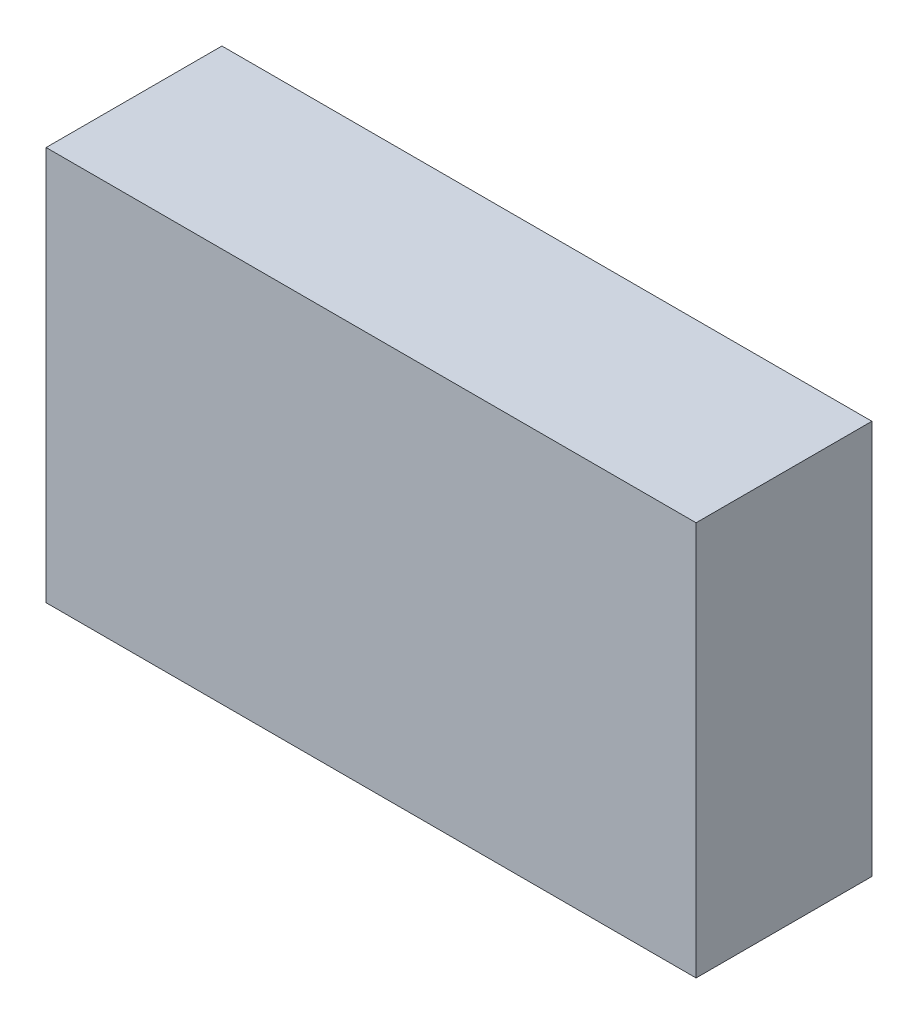
ISO-10303-21;
HEADER;
FILE_DESCRIPTION(('STEP AP214'),'2;1');
FILE_NAME('part.step','',(''),(''),'','','');
FILE_SCHEMA(('AUTOMOTIVE_DESIGN { 1 0 10303 214 1 1 1 1 }'));
ENDSEC;
DATA;
#1=APPLICATION_CONTEXT('core data for automotive mechanical design processes');
#2=APPLICATION_PROTOCOL_DEFINITION('international standard','automotive_design',2000,#1);
#3=PRODUCT_CONTEXT('',#1,'mechanical');
#4=PRODUCT('Part','Part','',(#3));
#5=PRODUCT_RELATED_PRODUCT_CATEGORY('part','',(#4));
#6=PRODUCT_DEFINITION_FORMATION('','',#4);
#7=PRODUCT_DEFINITION_CONTEXT('part definition',#1,'design');
#8=PRODUCT_DEFINITION('design','',#6,#7);
#9=PRODUCT_DEFINITION_SHAPE('','',#8);
#10=(LENGTH_UNIT() NAMED_UNIT(*) SI_UNIT(.MILLI.,.METRE.));
#11=(NAMED_UNIT(*) PLANE_ANGLE_UNIT() SI_UNIT($,.RADIAN.));
#12=(NAMED_UNIT(*) SI_UNIT($,.STERADIAN.) SOLID_ANGLE_UNIT());
#13=UNCERTAINTY_MEASURE_WITH_UNIT(LENGTH_MEASURE(1.E-05),#10,'distance_accuracy_value','');
#14=(GEOMETRIC_REPRESENTATION_CONTEXT(3) GLOBAL_UNCERTAINTY_ASSIGNED_CONTEXT((#13)) GLOBAL_UNIT_ASSIGNED_CONTEXT((#10,
#11,#12)) REPRESENTATION_CONTEXT('',''));
#15=CARTESIAN_POINT('',(0.,0.,0.));
#16=DIRECTION('',(0.,0.,1.));
#17=DIRECTION('',(1.,0.,0.));
#18=AXIS2_PLACEMENT_3D('',#15,#16,#17);
#19=CARTESIAN_POINT('',(154.94,93.98,83.82));
#20=DIRECTION('',(-1.,0.,0.));
#21=DIRECTION('',(0.,0.,1.));
#22=AXIS2_PLACEMENT_3D('',#19,#20,#21);
#23=PLANE('',#22);
#24=DIRECTION('',(0.,1.,0.));
#25=VECTOR('',#24,1.);
#26=CARTESIAN_POINT('',(154.94,93.98,0.));
#27=LINE('',#26,#25);
#28=CARTESIAN_POINT('',(154.94,-93.98,0.));
#29=VERTEX_POINT('',#28);
#30=CARTESIAN_POINT('',(154.94,93.98,0.));
#31=VERTEX_POINT('',#30);
#32=EDGE_CURVE('E106',#29,#31,#27,.T.);
#33=ORIENTED_EDGE('',*,*,#32,.T.);
#34=DIRECTION('',(0.,0.,-1.));
#35=VECTOR('',#34,1.);
#36=CARTESIAN_POINT('',(154.94,93.98,83.82));
#37=LINE('',#36,#35);
#38=CARTESIAN_POINT('',(154.94,93.98,83.82));
#39=VERTEX_POINT('',#38);
#40=EDGE_CURVE('E11',#39,#31,#37,.T.);
#41=ORIENTED_EDGE('',*,*,#40,.F.);
#42=DIRECTION('',(0.,1.,0.));
#43=VECTOR('',#42,1.);
#44=CARTESIAN_POINT('',(154.94,93.98,83.82));
#45=LINE('',#44,#43);
#46=CARTESIAN_POINT('',(154.94,-93.98,83.82));
#47=VERTEX_POINT('',#46);
#48=EDGE_CURVE('E94',#47,#39,#45,.T.);
#49=ORIENTED_EDGE('',*,*,#48,.F.);
#50=DIRECTION('',(0.,0.,-1.));
#51=VECTOR('',#50,1.);
#52=CARTESIAN_POINT('',(154.94,-93.98,83.82));
#53=LINE('',#52,#51);
#54=EDGE_CURVE('E102',#47,#29,#53,.T.);
#55=ORIENTED_EDGE('',*,*,#54,.T.);
#56=EDGE_LOOP('',(#33,#41,#49,#55));
#57=FACE_BOUND('',#56,.T.);
#58=ADVANCED_FACE('F43',(#57),#23,.F.);
#59=CARTESIAN_POINT('',(-154.94,93.98,83.82));
#60=DIRECTION('',(0.,-1.,0.));
#61=DIRECTION('',(0.,0.,-1.));
#62=AXIS2_PLACEMENT_3D('',#59,#60,#61);
#63=PLANE('',#62);
#64=DIRECTION('',(-1.,0.,0.));
#65=VECTOR('',#64,1.);
#66=CARTESIAN_POINT('',(-154.94,93.98,0.));
#67=LINE('',#66,#65);
#68=CARTESIAN_POINT('',(-154.94,93.98,0.));
#69=VERTEX_POINT('',#68);
#70=EDGE_CURVE('E98',#31,#69,#67,.T.);
#71=ORIENTED_EDGE('',*,*,#70,.T.);
#72=DIRECTION('',(0.,0.,-1.));
#73=VECTOR('',#72,1.);
#74=CARTESIAN_POINT('',(-154.94,93.98,83.82));
#75=LINE('',#74,#73);
#76=CARTESIAN_POINT('',(-154.94,93.98,83.82));
#77=VERTEX_POINT('',#76);
#78=EDGE_CURVE('E51',#77,#69,#75,.T.);
#79=ORIENTED_EDGE('',*,*,#78,.F.);
#80=DIRECTION('',(-1.,0.,0.));
#81=VECTOR('',#80,1.);
#82=CARTESIAN_POINT('',(-154.94,93.98,83.82));
#83=LINE('',#82,#81);
#84=EDGE_CURVE('E89',#39,#77,#83,.T.);
#85=ORIENTED_EDGE('',*,*,#84,.F.);
#86=ORIENTED_EDGE('',*,*,#40,.T.);
#87=EDGE_LOOP('',(#71,#79,#85,#86));
#88=FACE_BOUND('',#87,.T.);
#89=ADVANCED_FACE('F97',(#88),#63,.F.);
#90=CARTESIAN_POINT('',(-154.94,93.98,83.82));
#91=DIRECTION('',(1.,0.,0.));
#92=DIRECTION('',(0.,1.,0.));
#93=AXIS2_PLACEMENT_3D('',#90,#91,#92);
#94=PLANE('',#93);
#95=DIRECTION('',(0.,-1.,0.));
#96=VECTOR('',#95,1.);
#97=CARTESIAN_POINT('',(-154.94,93.98,0.));
#98=LINE('',#97,#96);
#99=CARTESIAN_POINT('',(-154.94,-93.98,0.));
#100=VERTEX_POINT('',#99);
#101=EDGE_CURVE('E76',#69,#100,#98,.T.);
#102=ORIENTED_EDGE('',*,*,#101,.T.);
#103=DIRECTION('',(0.,0.,-1.));
#104=VECTOR('',#103,1.);
#105=CARTESIAN_POINT('',(-154.94,-93.98,83.82));
#106=LINE('',#105,#104);
#107=CARTESIAN_POINT('',(-154.94,-93.98,83.82));
#108=VERTEX_POINT('',#107);
#109=EDGE_CURVE('E99',#108,#100,#106,.T.);
#110=ORIENTED_EDGE('',*,*,#109,.F.);
#111=DIRECTION('',(0.,-1.,0.));
#112=VECTOR('',#111,1.);
#113=CARTESIAN_POINT('',(-154.94,93.98,83.82));
#114=LINE('',#113,#112);
#115=EDGE_CURVE('E92',#77,#108,#114,.T.);
#116=ORIENTED_EDGE('',*,*,#115,.F.);
#117=ORIENTED_EDGE('',*,*,#78,.T.);
#118=EDGE_LOOP('',(#102,#110,#116,#117));
#119=FACE_BOUND('',#118,.T.);
#120=ADVANCED_FACE('F100',(#119),#94,.F.);
#121=CARTESIAN_POINT('',(-154.94,-93.98,83.82));
#122=DIRECTION('',(0.,1.,0.));
#123=DIRECTION('',(0.,0.,1.));
#124=AXIS2_PLACEMENT_3D('',#121,#122,#123);
#125=PLANE('',#124);
#126=DIRECTION('',(1.,0.,0.));
#127=VECTOR('',#126,1.);
#128=CARTESIAN_POINT('',(-154.94,-93.98,0.));
#129=LINE('',#128,#127);
#130=EDGE_CURVE('E82',#100,#29,#129,.T.);
#131=ORIENTED_EDGE('',*,*,#130,.T.);
#132=ORIENTED_EDGE('',*,*,#54,.F.);
#133=DIRECTION('',(1.,0.,0.));
#134=VECTOR('',#133,1.);
#135=CARTESIAN_POINT('',(-154.94,-93.98,83.82));
#136=LINE('',#135,#134);
#137=EDGE_CURVE('E59',#108,#47,#136,.T.);
#138=ORIENTED_EDGE('',*,*,#137,.F.);
#139=ORIENTED_EDGE('',*,*,#109,.T.);
#140=EDGE_LOOP('',(#131,#132,#138,#139));
#141=FACE_BOUND('',#140,.T.);
#142=ADVANCED_FACE('F113',(#141),#125,.F.);
#143=CARTESIAN_POINT('',(0.,0.,83.82));
#144=DIRECTION('',(0.,0.,1.));
#145=DIRECTION('',(1.,0.,0.));
#146=AXIS2_PLACEMENT_3D('',#143,#144,#145);
#147=PLANE('',#146);
#148=ORIENTED_EDGE('',*,*,#48,.T.);
#149=ORIENTED_EDGE('',*,*,#84,.T.);
#150=ORIENTED_EDGE('',*,*,#115,.T.);
#151=ORIENTED_EDGE('',*,*,#137,.T.);
#152=EDGE_LOOP('',(#148,#149,#150,#151));
#153=FACE_BOUND('',#152,.T.);
#154=ADVANCED_FACE('F90',(#153),#147,.T.);
#155=CARTESIAN_POINT('',(0.,0.,0.));
#156=DIRECTION('',(0.,0.,1.));
#157=DIRECTION('',(1.,0.,0.));
#158=AXIS2_PLACEMENT_3D('',#155,#156,#157);
#159=PLANE('',#158);
#160=ORIENTED_EDGE('',*,*,#32,.F.);
#161=ORIENTED_EDGE('',*,*,#130,.F.);
#162=ORIENTED_EDGE('',*,*,#101,.F.);
#163=ORIENTED_EDGE('',*,*,#70,.F.);
#164=EDGE_LOOP('',(#160,#161,#162,#163));
#165=FACE_BOUND('',#164,.T.);
#166=ADVANCED_FACE('F116',(#165),#159,.F.);
#167=CLOSED_SHELL('',(#58,#89,#120,#142,#154,#166));
#168=MANIFOLD_SOLID_BREP('B2',#167);
#169=ADVANCED_BREP_SHAPE_REPRESENTATION('',(#18,#168),#14);
#170=SHAPE_DEFINITION_REPRESENTATION(#9,#169);
ENDSEC;
END-ISO-10303-21;
